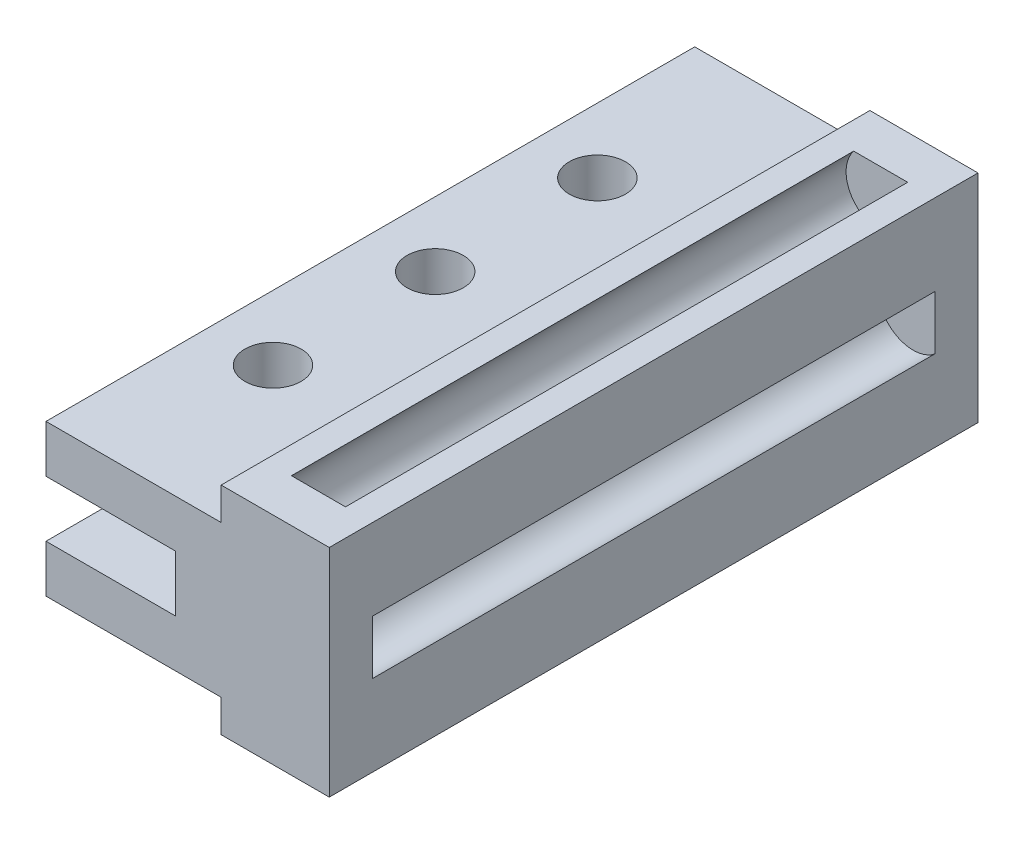
ISO-10303-21;
HEADER;
FILE_DESCRIPTION(('STEP AP214'),'2;1');
FILE_NAME('part.step','',(''),(''),'','','');
FILE_SCHEMA(('AUTOMOTIVE_DESIGN { 1 0 10303 214 1 1 1 1 }'));
ENDSEC;
DATA;
#1=APPLICATION_CONTEXT('core data for automotive mechanical design processes');
#2=APPLICATION_PROTOCOL_DEFINITION('international standard','automotive_design',2000,#1);
#3=PRODUCT_CONTEXT('',#1,'mechanical');
#4=PRODUCT('Part','Part','',(#3));
#5=PRODUCT_RELATED_PRODUCT_CATEGORY('part','',(#4));
#6=PRODUCT_DEFINITION_FORMATION('','',#4);
#7=PRODUCT_DEFINITION_CONTEXT('part definition',#1,'design');
#8=PRODUCT_DEFINITION('design','',#6,#7);
#9=PRODUCT_DEFINITION_SHAPE('','',#8);
#10=(LENGTH_UNIT() NAMED_UNIT(*) SI_UNIT(.MILLI.,.METRE.));
#11=(NAMED_UNIT(*) PLANE_ANGLE_UNIT() SI_UNIT($,.RADIAN.));
#12=(NAMED_UNIT(*) SI_UNIT($,.STERADIAN.) SOLID_ANGLE_UNIT());
#13=UNCERTAINTY_MEASURE_WITH_UNIT(LENGTH_MEASURE(1.E-05),#10,'distance_accuracy_value','');
#14=(GEOMETRIC_REPRESENTATION_CONTEXT(3) GLOBAL_UNCERTAINTY_ASSIGNED_CONTEXT((#13)) GLOBAL_UNIT_ASSIGNED_CONTEXT((#10,
#11,#12)) REPRESENTATION_CONTEXT('',''));
#15=CARTESIAN_POINT('',(0.,0.,0.));
#16=DIRECTION('',(0.,0.,1.));
#17=DIRECTION('',(1.,0.,0.));
#18=AXIS2_PLACEMENT_3D('',#15,#16,#17);
#19=CARTESIAN_POINT('',(2.5,-4.,30.));
#20=DIRECTION('',(0.,0.,-1.));
#21=DIRECTION('',(-1.,0.,0.));
#22=AXIS2_PLACEMENT_3D('',#19,#20,#21);
#23=CYLINDRICAL_SURFACE('',#22,1.6);
#24=CARTESIAN_POINT('',(2.5,-4.,2.));
#25=DIRECTION('',(0.,0.,-1.));
#26=DIRECTION('',(-1.,0.,0.));
#27=AXIS2_PLACEMENT_3D('',#24,#25,#26);
#28=CIRCLE('',#27,1.6);
#29=CARTESIAN_POINT('',(3.74899959967968,-5.,2.));
#30=VERTEX_POINT('',#29);
#31=CARTESIAN_POINT('',(1.25100040032032,-5.,2.));
#32=VERTEX_POINT('',#31);
#33=EDGE_CURVE('E50',#30,#32,#28,.F.);
#34=ORIENTED_EDGE('',*,*,#33,.F.);
#35=DIRECTION('',(0.,0.,-1.));
#36=VECTOR('',#35,1.);
#37=CARTESIAN_POINT('',(3.74899959967968,-5.,30.));
#38=LINE('',#37,#36);
#39=CARTESIAN_POINT('',(3.74899959967968,-5.,28.));
#40=VERTEX_POINT('',#39);
#41=EDGE_CURVE('E44',#40,#30,#38,.T.);
#42=ORIENTED_EDGE('',*,*,#41,.F.);
#43=CARTESIAN_POINT('',(2.5,-4.,28.));
#44=DIRECTION('',(0.,0.,-1.));
#45=DIRECTION('',(-1.,0.,0.));
#46=AXIS2_PLACEMENT_3D('',#43,#44,#45);
#47=CIRCLE('',#46,1.6);
#48=CARTESIAN_POINT('',(1.25100040032032,-5.,28.));
#49=VERTEX_POINT('',#48);
#50=EDGE_CURVE('E174',#40,#49,#47,.F.);
#51=ORIENTED_EDGE('',*,*,#50,.T.);
#52=DIRECTION('',(0.,0.,-1.));
#53=VECTOR('',#52,1.);
#54=CARTESIAN_POINT('',(1.25100040032032,-5.,30.));
#55=LINE('',#54,#53);
#56=EDGE_CURVE('E11',#49,#32,#55,.T.);
#57=ORIENTED_EDGE('',*,*,#56,.T.);
#58=EDGE_LOOP('',(#34,#42,#51,#57));
#59=FACE_BOUND('',#58,.T.);
#60=ADVANCED_FACE('F37',(#59),#23,.F.);
#61=CARTESIAN_POINT('',(4.,0.,30.));
#62=DIRECTION('',(0.,0.,-1.));
#63=DIRECTION('',(-1.,0.,0.));
#64=AXIS2_PLACEMENT_3D('',#61,#62,#63);
#65=CYLINDRICAL_SURFACE('',#64,1.6);
#66=CARTESIAN_POINT('',(4.,0.,2.));
#67=DIRECTION('',(0.,0.,-1.));
#68=DIRECTION('',(-1.,0.,0.));
#69=AXIS2_PLACEMENT_3D('',#66,#67,#68);
#70=CIRCLE('',#69,1.6);
#71=CARTESIAN_POINT('',(5.,1.24899959967968,2.));
#72=VERTEX_POINT('',#71);
#73=CARTESIAN_POINT('',(5.,-1.24899959967968,2.));
#74=VERTEX_POINT('',#73);
#75=EDGE_CURVE('E200',#72,#74,#70,.F.);
#76=ORIENTED_EDGE('',*,*,#75,.F.);
#77=DIRECTION('',(0.,0.,-1.));
#78=VECTOR('',#77,1.);
#79=CARTESIAN_POINT('',(5.,1.24899959967968,30.));
#80=LINE('',#79,#78);
#81=CARTESIAN_POINT('',(5.,1.24899959967968,28.));
#82=VERTEX_POINT('',#81);
#83=EDGE_CURVE('E173',#82,#72,#80,.T.);
#84=ORIENTED_EDGE('',*,*,#83,.F.);
#85=CARTESIAN_POINT('',(4.,0.,28.));
#86=DIRECTION('',(0.,0.,-1.));
#87=DIRECTION('',(-1.,0.,0.));
#88=AXIS2_PLACEMENT_3D('',#85,#86,#87);
#89=CIRCLE('',#88,1.6);
#90=CARTESIAN_POINT('',(5.,-1.24899959967968,28.));
#91=VERTEX_POINT('',#90);
#92=EDGE_CURVE('E161',#82,#91,#89,.F.);
#93=ORIENTED_EDGE('',*,*,#92,.T.);
#94=DIRECTION('',(0.,0.,-1.));
#95=VECTOR('',#94,1.);
#96=CARTESIAN_POINT('',(5.,-1.24899959967968,30.));
#97=LINE('',#96,#95);
#98=EDGE_CURVE('E171',#91,#74,#97,.T.);
#99=ORIENTED_EDGE('',*,*,#98,.T.);
#100=EDGE_LOOP('',(#76,#84,#93,#99));
#101=FACE_BOUND('',#100,.T.);
#102=ADVANCED_FACE('F170',(#101),#65,.F.);
#103=CARTESIAN_POINT('',(2.5,4.,30.));
#104=DIRECTION('',(0.,0.,-1.));
#105=DIRECTION('',(-1.,0.,0.));
#106=AXIS2_PLACEMENT_3D('',#103,#104,#105);
#107=CYLINDRICAL_SURFACE('',#106,1.6);
#108=CARTESIAN_POINT('',(2.5,4.,2.));
#109=DIRECTION('',(0.,0.,-1.));
#110=DIRECTION('',(-1.,0.,0.));
#111=AXIS2_PLACEMENT_3D('',#108,#109,#110);
#112=CIRCLE('',#111,1.6);
#113=CARTESIAN_POINT('',(1.25100040032032,5.,2.));
#114=VERTEX_POINT('',#113);
#115=CARTESIAN_POINT('',(3.74899959967968,5.,2.));
#116=VERTEX_POINT('',#115);
#117=EDGE_CURVE('E197',#114,#116,#112,.F.);
#118=ORIENTED_EDGE('',*,*,#117,.F.);
#119=DIRECTION('',(0.,0.,-1.));
#120=VECTOR('',#119,1.);
#121=CARTESIAN_POINT('',(1.25100040032032,5.,30.));
#122=LINE('',#121,#120);
#123=CARTESIAN_POINT('',(1.25100040032032,5.,28.));
#124=VERTEX_POINT('',#123);
#125=EDGE_CURVE('E335',#124,#114,#122,.T.);
#126=ORIENTED_EDGE('',*,*,#125,.F.);
#127=CARTESIAN_POINT('',(2.5,4.,28.));
#128=DIRECTION('',(0.,0.,-1.));
#129=DIRECTION('',(-1.,0.,0.));
#130=AXIS2_PLACEMENT_3D('',#127,#128,#129);
#131=CIRCLE('',#130,1.6);
#132=CARTESIAN_POINT('',(3.74899959967968,5.,28.));
#133=VERTEX_POINT('',#132);
#134=EDGE_CURVE('E175',#124,#133,#131,.F.);
#135=ORIENTED_EDGE('',*,*,#134,.T.);
#136=DIRECTION('',(0.,0.,-1.));
#137=VECTOR('',#136,1.);
#138=CARTESIAN_POINT('',(3.74899959967968,5.,30.));
#139=LINE('',#138,#137);
#140=EDGE_CURVE('E338',#133,#116,#139,.T.);
#141=ORIENTED_EDGE('',*,*,#140,.T.);
#142=EDGE_LOOP('',(#118,#126,#135,#141));
#143=FACE_BOUND('',#142,.T.);
#144=ADVANCED_FACE('F408',(#143),#107,.F.);
#145=CARTESIAN_POINT('',(0.,-5.,30.));
#146=DIRECTION('',(0.,-1.,0.));
#147=DIRECTION('',(0.,0.,-1.));
#148=AXIS2_PLACEMENT_3D('',#145,#146,#147);
#149=PLANE('',#148);
#150=DIRECTION('',(-1.,0.,0.));
#151=VECTOR('',#150,1.);
#152=CARTESIAN_POINT('',(0.,-5.,2.));
#153=LINE('',#152,#151);
#154=EDGE_CURVE('E194',#30,#32,#153,.T.);
#155=ORIENTED_EDGE('',*,*,#154,.T.);
#156=ORIENTED_EDGE('',*,*,#56,.F.);
#157=DIRECTION('',(1.,0.,0.));
#158=VECTOR('',#157,1.);
#159=CARTESIAN_POINT('',(5.,-5.,28.));
#160=LINE('',#159,#158);
#161=EDGE_CURVE('E167',#49,#40,#160,.T.);
#162=ORIENTED_EDGE('',*,*,#161,.T.);
#163=ORIENTED_EDGE('',*,*,#41,.T.);
#164=EDGE_LOOP('',(#155,#156,#162,#163));
#165=FACE_BOUND('',#164,.T.);
#166=DIRECTION('',(-1.,0.,0.));
#167=VECTOR('',#166,1.);
#168=CARTESIAN_POINT('',(0.,-5.,0.));
#169=LINE('',#168,#167);
#170=CARTESIAN_POINT('',(5.,-5.,0.));
#171=VERTEX_POINT('',#170);
#172=CARTESIAN_POINT('',(0.,-5.,0.));
#173=VERTEX_POINT('',#172);
#174=EDGE_CURVE('E250',#171,#173,#169,.T.);
#175=ORIENTED_EDGE('',*,*,#174,.F.);
#176=DIRECTION('',(0.,0.,-1.));
#177=VECTOR('',#176,1.);
#178=CARTESIAN_POINT('',(5.,-5.,30.));
#179=LINE('',#178,#177);
#180=CARTESIAN_POINT('',(5.,-5.,30.));
#181=VERTEX_POINT('',#180);
#182=EDGE_CURVE('E182',#181,#171,#179,.T.);
#183=ORIENTED_EDGE('',*,*,#182,.F.);
#184=DIRECTION('',(-1.,0.,0.));
#185=VECTOR('',#184,1.);
#186=CARTESIAN_POINT('',(0.,-5.,30.));
#187=LINE('',#186,#185);
#188=CARTESIAN_POINT('',(0.,-5.,30.));
#189=VERTEX_POINT('',#188);
#190=EDGE_CURVE('E251',#181,#189,#187,.T.);
#191=ORIENTED_EDGE('',*,*,#190,.T.);
#192=DIRECTION('',(0.,0.,-1.));
#193=VECTOR('',#192,1.);
#194=CARTESIAN_POINT('',(0.,-5.,30.));
#195=LINE('',#194,#193);
#196=EDGE_CURVE('E281',#189,#173,#195,.T.);
#197=ORIENTED_EDGE('',*,*,#196,.T.);
#198=EDGE_LOOP('',(#175,#183,#191,#197));
#199=FACE_BOUND('',#198,.T.);
#200=ADVANCED_FACE('F192',(#165,#199),#149,.T.);
#201=CARTESIAN_POINT('',(5.,0.,30.));
#202=DIRECTION('',(1.,0.,0.));
#203=DIRECTION('',(0.,1.,0.));
#204=AXIS2_PLACEMENT_3D('',#201,#202,#203);
#205=PLANE('',#204);
#206=DIRECTION('',(0.,-1.,0.));
#207=VECTOR('',#206,1.);
#208=CARTESIAN_POINT('',(5.,0.,2.));
#209=LINE('',#208,#207);
#210=EDGE_CURVE('E181',#72,#74,#209,.T.);
#211=ORIENTED_EDGE('',*,*,#210,.T.);
#212=ORIENTED_EDGE('',*,*,#98,.F.);
#213=DIRECTION('',(0.,1.,0.));
#214=VECTOR('',#213,1.);
#215=CARTESIAN_POINT('',(5.,5.,28.));
#216=LINE('',#215,#214);
#217=EDGE_CURVE('E158',#91,#82,#216,.T.);
#218=ORIENTED_EDGE('',*,*,#217,.T.);
#219=ORIENTED_EDGE('',*,*,#83,.T.);
#220=EDGE_LOOP('',(#211,#212,#218,#219));
#221=FACE_BOUND('',#220,.T.);
#222=DIRECTION('',(0.,-1.,0.));
#223=VECTOR('',#222,1.);
#224=CARTESIAN_POINT('',(5.,0.,0.));
#225=LINE('',#224,#223);
#226=CARTESIAN_POINT('',(5.,5.,0.));
#227=VERTEX_POINT('',#226);
#228=EDGE_CURVE('E284',#227,#171,#225,.T.);
#229=ORIENTED_EDGE('',*,*,#228,.F.);
#230=DIRECTION('',(0.,0.,-1.));
#231=VECTOR('',#230,1.);
#232=CARTESIAN_POINT('',(5.,5.,30.));
#233=LINE('',#232,#231);
#234=CARTESIAN_POINT('',(5.,5.,30.));
#235=VERTEX_POINT('',#234);
#236=EDGE_CURVE('E185',#235,#227,#233,.T.);
#237=ORIENTED_EDGE('',*,*,#236,.F.);
#238=DIRECTION('',(0.,-1.,0.));
#239=VECTOR('',#238,1.);
#240=CARTESIAN_POINT('',(5.,0.,30.));
#241=LINE('',#240,#239);
#242=EDGE_CURVE('E254',#235,#181,#241,.T.);
#243=ORIENTED_EDGE('',*,*,#242,.T.);
#244=ORIENTED_EDGE('',*,*,#182,.T.);
#245=EDGE_LOOP('',(#229,#237,#243,#244));
#246=FACE_BOUND('',#245,.T.);
#247=ADVANCED_FACE('F178',(#221,#246),#205,.T.);
#248=CARTESIAN_POINT('',(0.,5.,30.));
#249=DIRECTION('',(0.,-1.,0.));
#250=DIRECTION('',(1.,0.,0.));
#251=AXIS2_PLACEMENT_3D('',#248,#249,#250);
#252=PLANE('',#251);
#253=DIRECTION('',(1.,0.,0.));
#254=VECTOR('',#253,1.);
#255=CARTESIAN_POINT('',(0.,5.,2.));
#256=LINE('',#255,#254);
#257=EDGE_CURVE('E202',#114,#116,#256,.T.);
#258=ORIENTED_EDGE('',*,*,#257,.T.);
#259=ORIENTED_EDGE('',*,*,#140,.F.);
#260=DIRECTION('',(-1.,0.,0.));
#261=VECTOR('',#260,1.);
#262=CARTESIAN_POINT('',(0.,5.,28.));
#263=LINE('',#262,#261);
#264=EDGE_CURVE('E166',#133,#124,#263,.T.);
#265=ORIENTED_EDGE('',*,*,#264,.T.);
#266=ORIENTED_EDGE('',*,*,#125,.T.);
#267=EDGE_LOOP('',(#258,#259,#265,#266));
#268=FACE_BOUND('',#267,.T.);
#269=ORIENTED_EDGE('',*,*,#236,.T.);
#270=DIRECTION('',(-1.,0.,0.));
#271=VECTOR('',#270,1.);
#272=CARTESIAN_POINT('',(0.,5.,0.));
#273=LINE('',#272,#271);
#274=CARTESIAN_POINT('',(0.,5.,0.));
#275=VERTEX_POINT('',#274);
#276=EDGE_CURVE('E287',#227,#275,#273,.T.);
#277=ORIENTED_EDGE('',*,*,#276,.T.);
#278=DIRECTION('',(0.,0.,-1.));
#279=VECTOR('',#278,1.);
#280=CARTESIAN_POINT('',(0.,5.,30.));
#281=LINE('',#280,#279);
#282=CARTESIAN_POINT('',(0.,5.,30.));
#283=VERTEX_POINT('',#282);
#284=EDGE_CURVE('E333',#283,#275,#281,.T.);
#285=ORIENTED_EDGE('',*,*,#284,.F.);
#286=DIRECTION('',(-1.,0.,0.));
#287=VECTOR('',#286,1.);
#288=CARTESIAN_POINT('',(0.,5.,30.));
#289=LINE('',#288,#287);
#290=EDGE_CURVE('E258',#235,#283,#289,.T.);
#291=ORIENTED_EDGE('',*,*,#290,.F.);
#292=EDGE_LOOP('',(#269,#277,#285,#291));
#293=FACE_BOUND('',#292,.T.);
#294=ADVANCED_FACE('F343',(#268,#293),#252,.F.);
#295=CARTESIAN_POINT('',(0.,0.,30.));
#296=DIRECTION('',(1.,0.,0.));
#297=DIRECTION('',(0.,0.,-1.));
#298=AXIS2_PLACEMENT_3D('',#295,#296,#297);
#299=PLANE('',#298);
#300=DIRECTION('',(0.,-1.,0.));
#301=VECTOR('',#300,1.);
#302=CARTESIAN_POINT('',(0.,0.,0.));
#303=LINE('',#302,#301);
#304=CARTESIAN_POINT('',(0.,3.5,0.));
#305=VERTEX_POINT('',#304);
#306=EDGE_CURVE('E290',#275,#305,#303,.T.);
#307=ORIENTED_EDGE('',*,*,#306,.T.);
#308=DIRECTION('',(0.,0.,-1.));
#309=VECTOR('',#308,1.);
#310=CARTESIAN_POINT('',(0.,3.5,30.));
#311=LINE('',#310,#309);
#312=CARTESIAN_POINT('',(0.,3.5,30.));
#313=VERTEX_POINT('',#312);
#314=EDGE_CURVE('E331',#313,#305,#311,.T.);
#315=ORIENTED_EDGE('',*,*,#314,.F.);
#316=DIRECTION('',(0.,-1.,0.));
#317=VECTOR('',#316,1.);
#318=CARTESIAN_POINT('',(0.,0.,30.));
#319=LINE('',#318,#317);
#320=EDGE_CURVE('E260',#283,#313,#319,.T.);
#321=ORIENTED_EDGE('',*,*,#320,.F.);
#322=ORIENTED_EDGE('',*,*,#284,.T.);
#323=EDGE_LOOP('',(#307,#315,#321,#322));
#324=FACE_BOUND('',#323,.T.);
#325=ADVANCED_FACE('F390',(#324),#299,.F.);
#326=CARTESIAN_POINT('',(0.,3.5,30.));
#327=DIRECTION('',(0.,1.,0.));
#328=DIRECTION('',(0.,0.,1.));
#329=AXIS2_PLACEMENT_3D('',#326,#327,#328);
#330=PLANE('',#329);
#331=CARTESIAN_POINT('',(-5.0999473810243,3.5,7.50137418613049));
#332=DIRECTION('',(0.,1.,0.));
#333=DIRECTION('',(0.,0.,1.));
#334=AXIS2_PLACEMENT_3D('',#331,#332,#333);
#335=CIRCLE('',#334,1.3);
#336=CARTESIAN_POINT('',(-5.0999473810243,3.5,8.80137418613049));
#337=VERTEX_POINT('',#336);
#338=EDGE_CURVE('E235',#337,#337,#335,.T.);
#339=ORIENTED_EDGE('',*,*,#338,.F.);
#340=EDGE_LOOP('',(#339));
#341=FACE_BOUND('',#340,.T.);
#342=CARTESIAN_POINT('',(-5.0999473810243,3.5,22.502748372261));
#343=DIRECTION('',(0.,1.,0.));
#344=DIRECTION('',(0.,0.,1.));
#345=AXIS2_PLACEMENT_3D('',#342,#343,#344);
#346=CIRCLE('',#345,1.3);
#347=CARTESIAN_POINT('',(-5.0999473810243,3.5,23.802748372261));
#348=VERTEX_POINT('',#347);
#349=EDGE_CURVE('E226',#348,#348,#346,.T.);
#350=ORIENTED_EDGE('',*,*,#349,.F.);
#351=EDGE_LOOP('',(#350));
#352=FACE_BOUND('',#351,.T.);
#353=CARTESIAN_POINT('',(-5.0999473810243,3.5,15.002748372261));
#354=DIRECTION('',(0.,1.,0.));
#355=DIRECTION('',(0.,0.,1.));
#356=AXIS2_PLACEMENT_3D('',#353,#354,#355);
#357=CIRCLE('',#356,1.3);
#358=CARTESIAN_POINT('',(-5.0999473810243,3.5,16.302748372261));
#359=VERTEX_POINT('',#358);
#360=EDGE_CURVE('E247',#359,#359,#357,.T.);
#361=ORIENTED_EDGE('',*,*,#360,.F.);
#362=EDGE_LOOP('',(#361));
#363=FACE_BOUND('',#362,.T.);
#364=DIRECTION('',(1.,0.,0.));
#365=VECTOR('',#364,1.);
#366=CARTESIAN_POINT('',(0.,3.5,0.));
#367=LINE('',#366,#365);
#368=CARTESIAN_POINT('',(-8.1,3.5,0.));
#369=VERTEX_POINT('',#368);
#370=EDGE_CURVE('E293',#369,#305,#367,.T.);
#371=ORIENTED_EDGE('',*,*,#370,.F.);
#372=DIRECTION('',(0.,0.,-1.));
#373=VECTOR('',#372,1.);
#374=CARTESIAN_POINT('',(-8.1,3.5,30.));
#375=LINE('',#374,#373);
#376=CARTESIAN_POINT('',(-8.1,3.5,30.));
#377=VERTEX_POINT('',#376);
#378=EDGE_CURVE('E329',#377,#369,#375,.T.);
#379=ORIENTED_EDGE('',*,*,#378,.F.);
#380=DIRECTION('',(1.,0.,0.));
#381=VECTOR('',#380,1.);
#382=CARTESIAN_POINT('',(0.,3.5,30.));
#383=LINE('',#382,#381);
#384=EDGE_CURVE('E262',#377,#313,#383,.T.);
#385=ORIENTED_EDGE('',*,*,#384,.T.);
#386=ORIENTED_EDGE('',*,*,#314,.T.);
#387=EDGE_LOOP('',(#371,#379,#385,#386));
#388=FACE_BOUND('',#387,.T.);
#389=ADVANCED_FACE('F386',(#341,#352,#363,#388),#330,.T.);
#390=CARTESIAN_POINT('',(-8.1,0.,30.));
#391=DIRECTION('',(1.,0.,0.));
#392=DIRECTION('',(0.,0.,-1.));
#393=AXIS2_PLACEMENT_3D('',#390,#391,#392);
#394=PLANE('',#393);
#395=DIRECTION('',(0.,-1.,0.));
#396=VECTOR('',#395,1.);
#397=CARTESIAN_POINT('',(-8.1,0.,0.));
#398=LINE('',#397,#396);
#399=CARTESIAN_POINT('',(-8.1,1.3,0.));
#400=VERTEX_POINT('',#399);
#401=EDGE_CURVE('E296',#369,#400,#398,.T.);
#402=ORIENTED_EDGE('',*,*,#401,.T.);
#403=DIRECTION('',(0.,0.,-1.));
#404=VECTOR('',#403,1.);
#405=CARTESIAN_POINT('',(-8.1,1.3,30.));
#406=LINE('',#405,#404);
#407=CARTESIAN_POINT('',(-8.1,1.3,30.));
#408=VERTEX_POINT('',#407);
#409=EDGE_CURVE('E326',#408,#400,#406,.T.);
#410=ORIENTED_EDGE('',*,*,#409,.F.);
#411=DIRECTION('',(0.,-1.,0.));
#412=VECTOR('',#411,1.);
#413=CARTESIAN_POINT('',(-8.1,0.,30.));
#414=LINE('',#413,#412);
#415=EDGE_CURVE('E265',#377,#408,#414,.T.);
#416=ORIENTED_EDGE('',*,*,#415,.F.);
#417=ORIENTED_EDGE('',*,*,#378,.T.);
#418=EDGE_LOOP('',(#402,#410,#416,#417));
#419=FACE_BOUND('',#418,.T.);
#420=ADVANCED_FACE('F383',(#419),#394,.F.);
#421=CARTESIAN_POINT('',(0.,1.3,30.));
#422=DIRECTION('',(0.,1.,0.));
#423=DIRECTION('',(0.,0.,1.));
#424=AXIS2_PLACEMENT_3D('',#421,#422,#423);
#425=PLANE('',#424);
#426=CARTESIAN_POINT('',(-5.0999473810243,1.3,7.50137418613049));
#427=DIRECTION('',(0.,1.,0.));
#428=DIRECTION('',(0.,0.,1.));
#429=AXIS2_PLACEMENT_3D('',#426,#427,#428);
#430=CIRCLE('',#429,1.3);
#431=CARTESIAN_POINT('',(-5.0999473810243,1.3,8.80137418613049));
#432=VERTEX_POINT('',#431);
#433=EDGE_CURVE('E232',#432,#432,#430,.T.);
#434=ORIENTED_EDGE('',*,*,#433,.T.);
#435=EDGE_LOOP('',(#434));
#436=FACE_BOUND('',#435,.T.);
#437=CARTESIAN_POINT('',(-5.0999473810243,1.3,22.502748372261));
#438=DIRECTION('',(0.,1.,0.));
#439=DIRECTION('',(0.,0.,1.));
#440=AXIS2_PLACEMENT_3D('',#437,#438,#439);
#441=CIRCLE('',#440,1.3);
#442=CARTESIAN_POINT('',(-5.0999473810243,1.3,23.802748372261));
#443=VERTEX_POINT('',#442);
#444=EDGE_CURVE('E223',#443,#443,#441,.T.);
#445=ORIENTED_EDGE('',*,*,#444,.T.);
#446=EDGE_LOOP('',(#445));
#447=FACE_BOUND('',#446,.T.);
#448=CARTESIAN_POINT('',(-5.0999473810243,1.3,15.002748372261));
#449=DIRECTION('',(0.,1.,0.));
#450=DIRECTION('',(0.,0.,1.));
#451=AXIS2_PLACEMENT_3D('',#448,#449,#450);
#452=CIRCLE('',#451,1.3);
#453=CARTESIAN_POINT('',(-5.0999473810243,1.3,16.302748372261));
#454=VERTEX_POINT('',#453);
#455=EDGE_CURVE('E244',#454,#454,#452,.T.);
#456=ORIENTED_EDGE('',*,*,#455,.T.);
#457=EDGE_LOOP('',(#456));
#458=FACE_BOUND('',#457,.T.);
#459=DIRECTION('',(1.,0.,0.));
#460=VECTOR('',#459,1.);
#461=CARTESIAN_POINT('',(0.,1.3,0.));
#462=LINE('',#461,#460);
#463=CARTESIAN_POINT('',(-2.1,1.3,0.));
#464=VERTEX_POINT('',#463);
#465=EDGE_CURVE('E298',#400,#464,#462,.T.);
#466=ORIENTED_EDGE('',*,*,#465,.T.);
#467=DIRECTION('',(0.,0.,-1.));
#468=VECTOR('',#467,1.);
#469=CARTESIAN_POINT('',(-2.1,1.3,30.));
#470=LINE('',#469,#468);
#471=CARTESIAN_POINT('',(-2.1,1.3,30.));
#472=VERTEX_POINT('',#471);
#473=EDGE_CURVE('E323',#472,#464,#470,.T.);
#474=ORIENTED_EDGE('',*,*,#473,.F.);
#475=DIRECTION('',(1.,0.,0.));
#476=VECTOR('',#475,1.);
#477=CARTESIAN_POINT('',(0.,1.3,30.));
#478=LINE('',#477,#476);
#479=EDGE_CURVE('E267',#408,#472,#478,.T.);
#480=ORIENTED_EDGE('',*,*,#479,.F.);
#481=ORIENTED_EDGE('',*,*,#409,.T.);
#482=EDGE_LOOP('',(#466,#474,#480,#481));
#483=FACE_BOUND('',#482,.T.);
#484=ADVANCED_FACE('F378',(#436,#447,#458,#483),#425,.F.);
#485=CARTESIAN_POINT('',(-2.1,0.,30.));
#486=DIRECTION('',(1.,0.,0.));
#487=DIRECTION('',(0.,0.,-1.));
#488=AXIS2_PLACEMENT_3D('',#485,#486,#487);
#489=PLANE('',#488);
#490=DIRECTION('',(0.,-1.,0.));
#491=VECTOR('',#490,1.);
#492=CARTESIAN_POINT('',(-2.1,0.,0.));
#493=LINE('',#492,#491);
#494=CARTESIAN_POINT('',(-2.1,-1.3,0.));
#495=VERTEX_POINT('',#494);
#496=EDGE_CURVE('E300',#464,#495,#493,.T.);
#497=ORIENTED_EDGE('',*,*,#496,.T.);
#498=DIRECTION('',(0.,0.,-1.));
#499=VECTOR('',#498,1.);
#500=CARTESIAN_POINT('',(-2.1,-1.3,30.));
#501=LINE('',#500,#499);
#502=CARTESIAN_POINT('',(-2.1,-1.3,30.));
#503=VERTEX_POINT('',#502);
#504=EDGE_CURVE('E321',#503,#495,#501,.T.);
#505=ORIENTED_EDGE('',*,*,#504,.F.);
#506=DIRECTION('',(0.,-1.,0.));
#507=VECTOR('',#506,1.);
#508=CARTESIAN_POINT('',(-2.1,0.,30.));
#509=LINE('',#508,#507);
#510=EDGE_CURVE('E269',#472,#503,#509,.T.);
#511=ORIENTED_EDGE('',*,*,#510,.F.);
#512=ORIENTED_EDGE('',*,*,#473,.T.);
#513=EDGE_LOOP('',(#497,#505,#511,#512));
#514=FACE_BOUND('',#513,.T.);
#515=ADVANCED_FACE('F372',(#514),#489,.F.);
#516=CARTESIAN_POINT('',(0.,-1.3,30.));
#517=DIRECTION('',(0.,1.,0.));
#518=DIRECTION('',(0.,0.,1.));
#519=AXIS2_PLACEMENT_3D('',#516,#517,#518);
#520=PLANE('',#519);
#521=CARTESIAN_POINT('',(-5.0999473810243,-1.3,7.50137418613049));
#522=DIRECTION('',(0.,1.,0.));
#523=DIRECTION('',(0.,0.,1.));
#524=AXIS2_PLACEMENT_3D('',#521,#522,#523);
#525=CIRCLE('',#524,1.3);
#526=CARTESIAN_POINT('',(-5.0999473810243,-1.3,8.80137418613049));
#527=VERTEX_POINT('',#526);
#528=EDGE_CURVE('E229',#527,#527,#525,.T.);
#529=ORIENTED_EDGE('',*,*,#528,.F.);
#530=EDGE_LOOP('',(#529));
#531=FACE_BOUND('',#530,.T.);
#532=CARTESIAN_POINT('',(-5.0999473810243,-1.3,22.502748372261));
#533=DIRECTION('',(0.,1.,0.));
#534=DIRECTION('',(0.,0.,1.));
#535=AXIS2_PLACEMENT_3D('',#532,#533,#534);
#536=CIRCLE('',#535,1.3);
#537=CARTESIAN_POINT('',(-5.0999473810243,-1.3,23.802748372261));
#538=VERTEX_POINT('',#537);
#539=EDGE_CURVE('E218',#538,#538,#536,.T.);
#540=ORIENTED_EDGE('',*,*,#539,.F.);
#541=EDGE_LOOP('',(#540));
#542=FACE_BOUND('',#541,.T.);
#543=CARTESIAN_POINT('',(-5.0999473810243,-1.3,15.002748372261));
#544=DIRECTION('',(0.,1.,0.));
#545=DIRECTION('',(0.,0.,1.));
#546=AXIS2_PLACEMENT_3D('',#543,#544,#545);
#547=CIRCLE('',#546,1.3);
#548=CARTESIAN_POINT('',(-5.0999473810243,-1.3,16.302748372261));
#549=VERTEX_POINT('',#548);
#550=EDGE_CURVE('E241',#549,#549,#547,.T.);
#551=ORIENTED_EDGE('',*,*,#550,.F.);
#552=EDGE_LOOP('',(#551));
#553=FACE_BOUND('',#552,.T.);
#554=DIRECTION('',(1.,0.,0.));
#555=VECTOR('',#554,1.);
#556=CARTESIAN_POINT('',(0.,-1.3,0.));
#557=LINE('',#556,#555);
#558=CARTESIAN_POINT('',(-8.1,-1.3,0.));
#559=VERTEX_POINT('',#558);
#560=EDGE_CURVE('E303',#559,#495,#557,.T.);
#561=ORIENTED_EDGE('',*,*,#560,.F.);
#562=DIRECTION('',(0.,0.,-1.));
#563=VECTOR('',#562,1.);
#564=CARTESIAN_POINT('',(-8.1,-1.3,30.));
#565=LINE('',#564,#563);
#566=CARTESIAN_POINT('',(-8.1,-1.3,30.));
#567=VERTEX_POINT('',#566);
#568=EDGE_CURVE('E319',#567,#559,#565,.T.);
#569=ORIENTED_EDGE('',*,*,#568,.F.);
#570=DIRECTION('',(1.,0.,0.));
#571=VECTOR('',#570,1.);
#572=CARTESIAN_POINT('',(0.,-1.3,30.));
#573=LINE('',#572,#571);
#574=EDGE_CURVE('E271',#567,#503,#573,.T.);
#575=ORIENTED_EDGE('',*,*,#574,.T.);
#576=ORIENTED_EDGE('',*,*,#504,.T.);
#577=EDGE_LOOP('',(#561,#569,#575,#576));
#578=FACE_BOUND('',#577,.T.);
#579=ADVANCED_FACE('F366',(#531,#542,#553,#578),#520,.T.);
#580=CARTESIAN_POINT('',(-8.1,0.,30.));
#581=DIRECTION('',(1.,0.,0.));
#582=DIRECTION('',(0.,0.,-1.));
#583=AXIS2_PLACEMENT_3D('',#580,#581,#582);
#584=PLANE('',#583);
#585=DIRECTION('',(0.,-1.,0.));
#586=VECTOR('',#585,1.);
#587=CARTESIAN_POINT('',(-8.1,0.,0.));
#588=LINE('',#587,#586);
#589=CARTESIAN_POINT('',(-8.1,-3.5,0.));
#590=VERTEX_POINT('',#589);
#591=EDGE_CURVE('E306',#559,#590,#588,.T.);
#592=ORIENTED_EDGE('',*,*,#591,.T.);
#593=DIRECTION('',(0.,0.,-1.));
#594=VECTOR('',#593,1.);
#595=CARTESIAN_POINT('',(-8.1,-3.5,30.));
#596=LINE('',#595,#594);
#597=CARTESIAN_POINT('',(-8.1,-3.5,30.));
#598=VERTEX_POINT('',#597);
#599=EDGE_CURVE('E316',#598,#590,#596,.T.);
#600=ORIENTED_EDGE('',*,*,#599,.F.);
#601=DIRECTION('',(0.,-1.,0.));
#602=VECTOR('',#601,1.);
#603=CARTESIAN_POINT('',(-8.1,0.,30.));
#604=LINE('',#603,#602);
#605=EDGE_CURVE('E274',#567,#598,#604,.T.);
#606=ORIENTED_EDGE('',*,*,#605,.F.);
#607=ORIENTED_EDGE('',*,*,#568,.T.);
#608=EDGE_LOOP('',(#592,#600,#606,#607));
#609=FACE_BOUND('',#608,.T.);
#610=ADVANCED_FACE('F393',(#609),#584,.F.);
#611=CARTESIAN_POINT('',(0.,-3.5,30.));
#612=DIRECTION('',(0.,1.,0.));
#613=DIRECTION('',(0.,0.,1.));
#614=AXIS2_PLACEMENT_3D('',#611,#612,#613);
#615=PLANE('',#614);
#616=CARTESIAN_POINT('',(-5.0999473810243,-3.5,7.50137418613049));
#617=DIRECTION('',(0.,-1.,0.));
#618=DIRECTION('',(0.,0.,-1.));
#619=AXIS2_PLACEMENT_3D('',#616,#617,#618);
#620=CIRCLE('',#619,1.3);
#621=CARTESIAN_POINT('',(-5.0999473810243,-3.5,6.20137418613049));
#622=VERTEX_POINT('',#621);
#623=EDGE_CURVE('E215',#622,#622,#620,.T.);
#624=ORIENTED_EDGE('',*,*,#623,.F.);
#625=EDGE_LOOP('',(#624));
#626=FACE_BOUND('',#625,.T.);
#627=CARTESIAN_POINT('',(-5.0999473810243,-3.5,22.502748372261));
#628=DIRECTION('',(0.,-1.,0.));
#629=DIRECTION('',(0.,0.,-1.));
#630=AXIS2_PLACEMENT_3D('',#627,#628,#629);
#631=CIRCLE('',#630,1.3);
#632=CARTESIAN_POINT('',(-5.0999473810243,-3.5,21.202748372261));
#633=VERTEX_POINT('',#632);
#634=EDGE_CURVE('E214',#633,#633,#631,.T.);
#635=ORIENTED_EDGE('',*,*,#634,.F.);
#636=EDGE_LOOP('',(#635));
#637=FACE_BOUND('',#636,.T.);
#638=CARTESIAN_POINT('',(-5.0999473810243,-3.5,15.002748372261));
#639=DIRECTION('',(0.,-1.,0.));
#640=DIRECTION('',(0.,0.,-1.));
#641=AXIS2_PLACEMENT_3D('',#638,#639,#640);
#642=CIRCLE('',#641,1.3);
#643=CARTESIAN_POINT('',(-5.0999473810243,-3.5,13.702748372261));
#644=VERTEX_POINT('',#643);
#645=EDGE_CURVE('E238',#644,#644,#642,.T.);
#646=ORIENTED_EDGE('',*,*,#645,.F.);
#647=EDGE_LOOP('',(#646));
#648=FACE_BOUND('',#647,.T.);
#649=DIRECTION('',(1.,0.,0.));
#650=VECTOR('',#649,1.);
#651=CARTESIAN_POINT('',(0.,-3.5,0.));
#652=LINE('',#651,#650);
#653=CARTESIAN_POINT('',(0.,-3.5,0.));
#654=VERTEX_POINT('',#653);
#655=EDGE_CURVE('E308',#590,#654,#652,.T.);
#656=ORIENTED_EDGE('',*,*,#655,.T.);
#657=DIRECTION('',(0.,0.,-1.));
#658=VECTOR('',#657,1.);
#659=CARTESIAN_POINT('',(0.,-3.5,30.));
#660=LINE('',#659,#658);
#661=CARTESIAN_POINT('',(0.,-3.5,30.));
#662=VERTEX_POINT('',#661);
#663=EDGE_CURVE('E314',#662,#654,#660,.T.);
#664=ORIENTED_EDGE('',*,*,#663,.F.);
#665=DIRECTION('',(1.,0.,0.));
#666=VECTOR('',#665,1.);
#667=CARTESIAN_POINT('',(0.,-3.5,30.));
#668=LINE('',#667,#666);
#669=EDGE_CURVE('E276',#598,#662,#668,.T.);
#670=ORIENTED_EDGE('',*,*,#669,.F.);
#671=ORIENTED_EDGE('',*,*,#599,.T.);
#672=EDGE_LOOP('',(#656,#664,#670,#671));
#673=FACE_BOUND('',#672,.T.);
#674=ADVANCED_FACE('F359',(#626,#637,#648,#673),#615,.F.);
#675=CARTESIAN_POINT('',(0.,0.,30.));
#676=DIRECTION('',(-1.,0.,0.));
#677=DIRECTION('',(0.,0.,1.));
#678=AXIS2_PLACEMENT_3D('',#675,#676,#677);
#679=PLANE('',#678);
#680=DIRECTION('',(0.,1.,0.));
#681=VECTOR('',#680,1.);
#682=CARTESIAN_POINT('',(0.,0.,0.));
#683=LINE('',#682,#681);
#684=EDGE_CURVE('E255',#173,#654,#683,.T.);
#685=ORIENTED_EDGE('',*,*,#684,.F.);
#686=ORIENTED_EDGE('',*,*,#196,.F.);
#687=DIRECTION('',(0.,1.,0.));
#688=VECTOR('',#687,1.);
#689=CARTESIAN_POINT('',(0.,0.,30.));
#690=LINE('',#689,#688);
#691=EDGE_CURVE('E278',#189,#662,#690,.T.);
#692=ORIENTED_EDGE('',*,*,#691,.T.);
#693=ORIENTED_EDGE('',*,*,#663,.T.);
#694=EDGE_LOOP('',(#685,#686,#692,#693));
#695=FACE_BOUND('',#694,.T.);
#696=ADVANCED_FACE('F355',(#695),#679,.T.);
#697=CARTESIAN_POINT('',(0.,0.,30.));
#698=DIRECTION('',(0.,0.,1.));
#699=DIRECTION('',(1.,0.,0.));
#700=AXIS2_PLACEMENT_3D('',#697,#698,#699);
#701=PLANE('',#700);
#702=ORIENTED_EDGE('',*,*,#669,.T.);
#703=ORIENTED_EDGE('',*,*,#691,.F.);
#704=ORIENTED_EDGE('',*,*,#190,.F.);
#705=ORIENTED_EDGE('',*,*,#242,.F.);
#706=ORIENTED_EDGE('',*,*,#290,.T.);
#707=ORIENTED_EDGE('',*,*,#320,.T.);
#708=ORIENTED_EDGE('',*,*,#384,.F.);
#709=ORIENTED_EDGE('',*,*,#415,.T.);
#710=ORIENTED_EDGE('',*,*,#479,.T.);
#711=ORIENTED_EDGE('',*,*,#510,.T.);
#712=ORIENTED_EDGE('',*,*,#574,.F.);
#713=ORIENTED_EDGE('',*,*,#605,.T.);
#714=EDGE_LOOP('',(#702,#703,#704,#705,#706,#707,#708,#709,#710,#711,#712,#713));
#715=FACE_BOUND('',#714,.T.);
#716=ADVANCED_FACE('F392',(#715),#701,.T.);
#717=CARTESIAN_POINT('',(0.,0.,0.));
#718=DIRECTION('',(0.,0.,1.));
#719=DIRECTION('',(1.,0.,0.));
#720=AXIS2_PLACEMENT_3D('',#717,#718,#719);
#721=PLANE('',#720);
#722=ORIENTED_EDGE('',*,*,#684,.T.);
#723=ORIENTED_EDGE('',*,*,#655,.F.);
#724=ORIENTED_EDGE('',*,*,#591,.F.);
#725=ORIENTED_EDGE('',*,*,#560,.T.);
#726=ORIENTED_EDGE('',*,*,#496,.F.);
#727=ORIENTED_EDGE('',*,*,#465,.F.);
#728=ORIENTED_EDGE('',*,*,#401,.F.);
#729=ORIENTED_EDGE('',*,*,#370,.T.);
#730=ORIENTED_EDGE('',*,*,#306,.F.);
#731=ORIENTED_EDGE('',*,*,#276,.F.);
#732=ORIENTED_EDGE('',*,*,#228,.T.);
#733=ORIENTED_EDGE('',*,*,#174,.T.);
#734=EDGE_LOOP('',(#722,#723,#724,#725,#726,#727,#728,#729,#730,#731,#732,#733));
#735=FACE_BOUND('',#734,.T.);
#736=ADVANCED_FACE('F348',(#735),#721,.F.);
#737=CARTESIAN_POINT('',(-5.0999473810243,26.5,15.002748372261));
#738=DIRECTION('',(0.,-1.,0.));
#739=DIRECTION('',(0.,0.,-1.));
#740=AXIS2_PLACEMENT_3D('',#737,#738,#739);
#741=CYLINDRICAL_SURFACE('',#740,1.3);
#742=ORIENTED_EDGE('',*,*,#550,.T.);
#743=EDGE_LOOP('',(#742));
#744=FACE_BOUND('',#743,.T.);
#745=ORIENTED_EDGE('',*,*,#645,.T.);
#746=EDGE_LOOP('',(#745));
#747=FACE_BOUND('',#746,.T.);
#748=ADVANCED_FACE('F457',(#744,#747),#741,.F.);
#749=ORIENTED_EDGE('',*,*,#360,.T.);
#750=EDGE_LOOP('',(#749));
#751=FACE_BOUND('',#750,.T.);
#752=ORIENTED_EDGE('',*,*,#455,.F.);
#753=EDGE_LOOP('',(#752));
#754=FACE_BOUND('',#753,.T.);
#755=ADVANCED_FACE('F462',(#751,#754),#741,.F.);
#756=CARTESIAN_POINT('',(-5.0999473810243,26.5,22.502748372261));
#757=DIRECTION('',(0.,-1.,0.));
#758=DIRECTION('',(0.,0.,-1.));
#759=AXIS2_PLACEMENT_3D('',#756,#757,#758);
#760=CYLINDRICAL_SURFACE('',#759,1.3);
#761=ORIENTED_EDGE('',*,*,#539,.T.);
#762=EDGE_LOOP('',(#761));
#763=FACE_BOUND('',#762,.T.);
#764=ORIENTED_EDGE('',*,*,#634,.T.);
#765=EDGE_LOOP('',(#764));
#766=FACE_BOUND('',#765,.T.);
#767=ADVANCED_FACE('F474',(#763,#766),#760,.F.);
#768=CARTESIAN_POINT('',(-5.0999473810243,26.5,7.50137418613049));
#769=DIRECTION('',(0.,-1.,0.));
#770=DIRECTION('',(0.,0.,-1.));
#771=AXIS2_PLACEMENT_3D('',#768,#769,#770);
#772=CYLINDRICAL_SURFACE('',#771,1.3);
#773=ORIENTED_EDGE('',*,*,#528,.T.);
#774=EDGE_LOOP('',(#773));
#775=FACE_BOUND('',#774,.T.);
#776=ORIENTED_EDGE('',*,*,#623,.T.);
#777=EDGE_LOOP('',(#776));
#778=FACE_BOUND('',#777,.T.);
#779=ADVANCED_FACE('F483',(#775,#778),#772,.F.);
#780=ORIENTED_EDGE('',*,*,#349,.T.);
#781=EDGE_LOOP('',(#780));
#782=FACE_BOUND('',#781,.T.);
#783=ORIENTED_EDGE('',*,*,#444,.F.);
#784=EDGE_LOOP('',(#783));
#785=FACE_BOUND('',#784,.T.);
#786=ADVANCED_FACE('F486',(#782,#785),#760,.F.);
#787=ORIENTED_EDGE('',*,*,#338,.T.);
#788=EDGE_LOOP('',(#787));
#789=FACE_BOUND('',#788,.T.);
#790=ORIENTED_EDGE('',*,*,#433,.F.);
#791=EDGE_LOOP('',(#790));
#792=FACE_BOUND('',#791,.T.);
#793=ADVANCED_FACE('F496',(#789,#792),#772,.F.);
#794=CARTESIAN_POINT('',(0.,0.,28.));
#795=DIRECTION('',(0.,0.,-1.));
#796=DIRECTION('',(-1.,0.,0.));
#797=AXIS2_PLACEMENT_3D('',#794,#795,#796);
#798=PLANE('',#797);
#799=ORIENTED_EDGE('',*,*,#134,.F.);
#800=ORIENTED_EDGE('',*,*,#264,.F.);
#801=EDGE_LOOP('',(#799,#800));
#802=FACE_BOUND('',#801,.T.);
#803=ADVANCED_FACE('F512',(#802),#798,.T.);
#804=ORIENTED_EDGE('',*,*,#92,.F.);
#805=ORIENTED_EDGE('',*,*,#217,.F.);
#806=EDGE_LOOP('',(#804,#805));
#807=FACE_BOUND('',#806,.T.);
#808=ADVANCED_FACE('F160',(#807),#798,.T.);
#809=ORIENTED_EDGE('',*,*,#50,.F.);
#810=ORIENTED_EDGE('',*,*,#161,.F.);
#811=EDGE_LOOP('',(#809,#810));
#812=FACE_BOUND('',#811,.T.);
#813=ADVANCED_FACE('F535',(#812),#798,.T.);
#814=CARTESIAN_POINT('',(0.,0.,2.));
#815=DIRECTION('',(0.,0.,-1.));
#816=DIRECTION('',(-1.,0.,0.));
#817=AXIS2_PLACEMENT_3D('',#814,#815,#816);
#818=PLANE('',#817);
#819=ORIENTED_EDGE('',*,*,#257,.F.);
#820=ORIENTED_EDGE('',*,*,#117,.T.);
#821=EDGE_LOOP('',(#819,#820));
#822=FACE_BOUND('',#821,.T.);
#823=ADVANCED_FACE('F549',(#822),#818,.F.);
#824=ORIENTED_EDGE('',*,*,#210,.F.);
#825=ORIENTED_EDGE('',*,*,#75,.T.);
#826=EDGE_LOOP('',(#824,#825));
#827=FACE_BOUND('',#826,.T.);
#828=ADVANCED_FACE('F630',(#827),#818,.F.);
#829=ORIENTED_EDGE('',*,*,#154,.F.);
#830=ORIENTED_EDGE('',*,*,#33,.T.);
#831=EDGE_LOOP('',(#829,#830));
#832=FACE_BOUND('',#831,.T.);
#833=ADVANCED_FACE('F196',(#832),#818,.F.);
#834=CLOSED_SHELL('',(#60,#102,#144,#200,#247,#294,#325,#389,#420,#484,#515,#579,#610,#674,#696,
#716,#736,#748,#755,#767,#779,#786,#793,#803,#808,#813,#823,#828,#833));
#835=MANIFOLD_SOLID_BREP('B2',#834);
#836=ADVANCED_BREP_SHAPE_REPRESENTATION('',(#18,#835),#14);
#837=SHAPE_DEFINITION_REPRESENTATION(#9,#836);
ENDSEC;
END-ISO-10303-21;
